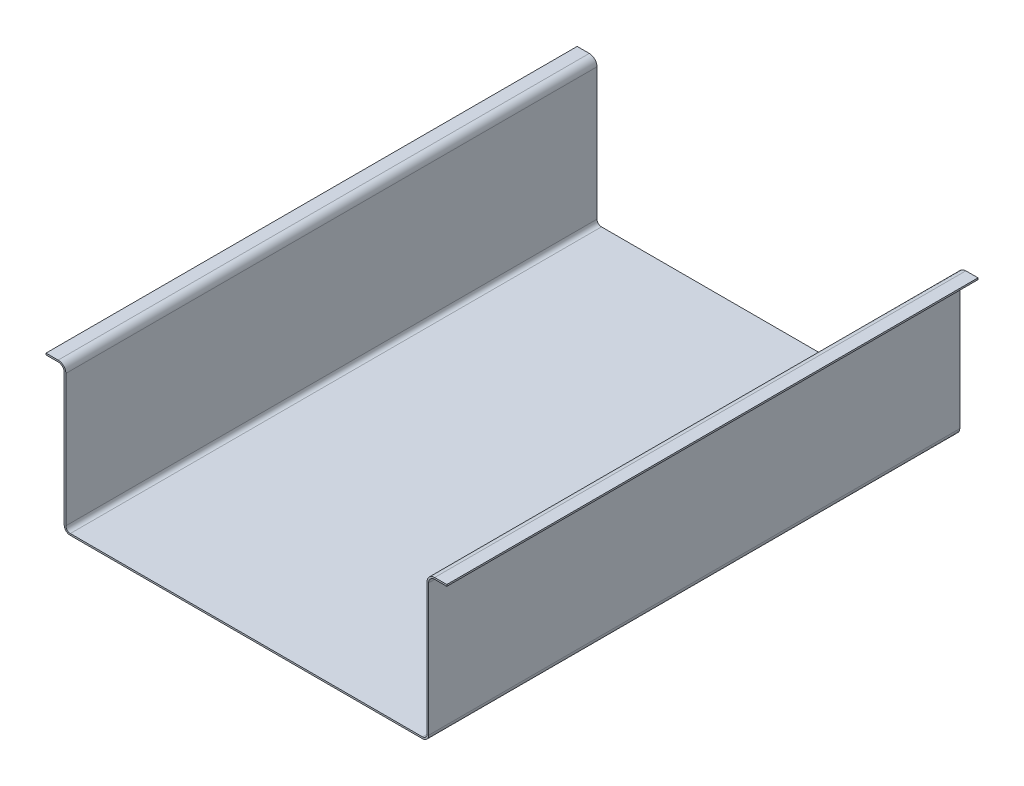
ISO-10303-21;
HEADER;
FILE_DESCRIPTION(('STEP AP214'),'2;1');
FILE_NAME('part.step','',(''),(''),'','','');
FILE_SCHEMA(('AUTOMOTIVE_DESIGN { 1 0 10303 214 1 1 1 1 }'));
ENDSEC;
DATA;
#1=APPLICATION_CONTEXT('core data for automotive mechanical design processes');
#2=APPLICATION_PROTOCOL_DEFINITION('international standard','automotive_design',2000,#1);
#3=PRODUCT_CONTEXT('',#1,'mechanical');
#4=PRODUCT('Part','Part','',(#3));
#5=PRODUCT_RELATED_PRODUCT_CATEGORY('part','',(#4));
#6=PRODUCT_DEFINITION_FORMATION('','',#4);
#7=PRODUCT_DEFINITION_CONTEXT('part definition',#1,'design');
#8=PRODUCT_DEFINITION('design','',#6,#7);
#9=PRODUCT_DEFINITION_SHAPE('','',#8);
#10=(LENGTH_UNIT() NAMED_UNIT(*) SI_UNIT(.MILLI.,.METRE.));
#11=(NAMED_UNIT(*) PLANE_ANGLE_UNIT() SI_UNIT($,.RADIAN.));
#12=(NAMED_UNIT(*) SI_UNIT($,.STERADIAN.) SOLID_ANGLE_UNIT());
#13=UNCERTAINTY_MEASURE_WITH_UNIT(LENGTH_MEASURE(1.E-05),#10,'distance_accuracy_value','');
#14=(GEOMETRIC_REPRESENTATION_CONTEXT(3) GLOBAL_UNCERTAINTY_ASSIGNED_CONTEXT((#13)) GLOBAL_UNIT_ASSIGNED_CONTEXT((#10,
#11,#12)) REPRESENTATION_CONTEXT('',''));
#15=CARTESIAN_POINT('',(0.,0.,0.));
#16=DIRECTION('',(0.,0.,1.));
#17=DIRECTION('',(1.,0.,0.));
#18=AXIS2_PLACEMENT_3D('',#15,#16,#17);
#19=CARTESIAN_POINT('',(-377.5837,-1.51893795707195E-13,555.3837));
#20=DIRECTION('',(-1.,0.,0.));
#21=DIRECTION('',(0.,-1.,0.));
#22=AXIS2_PLACEMENT_3D('',#19,#20,#21);
#23=PLANE('',#22);
#24=DIRECTION('',(0.,1.,0.));
#25=VECTOR('',#24,1.);
#26=CARTESIAN_POINT('',(-377.5837,-1.51893795707195E-13,-555.3837));
#27=LINE('',#26,#25);
#28=CARTESIAN_POINT('',(-377.5837,12.7,-555.3837));
#29=VERTEX_POINT('',#28);
#30=CARTESIAN_POINT('',(-377.5837,288.6837,-555.3837));
#31=VERTEX_POINT('',#30);
#32=EDGE_CURVE('E201',#29,#31,#27,.T.);
#33=ORIENTED_EDGE('',*,*,#32,.T.);
#34=DIRECTION('',(0.,0.,-1.));
#35=VECTOR('',#34,1.);
#36=CARTESIAN_POINT('',(-377.5837,288.6837,555.3837));
#37=LINE('',#36,#35);
#38=CARTESIAN_POINT('',(-377.5837,288.6837,555.3837));
#39=VERTEX_POINT('',#38);
#40=EDGE_CURVE('E11',#39,#31,#37,.T.);
#41=ORIENTED_EDGE('',*,*,#40,.F.);
#42=DIRECTION('',(0.,1.,0.));
#43=VECTOR('',#42,1.);
#44=CARTESIAN_POINT('',(-377.5837,-1.51893795707195E-13,555.3837));
#45=LINE('',#44,#43);
#46=CARTESIAN_POINT('',(-377.5837,12.7,555.3837));
#47=VERTEX_POINT('',#46);
#48=EDGE_CURVE('E252',#47,#39,#45,.T.);
#49=ORIENTED_EDGE('',*,*,#48,.F.);
#50=DIRECTION('',(0.,0.,-1.));
#51=VECTOR('',#50,1.);
#52=CARTESIAN_POINT('',(-377.5837,12.7,555.3837));
#53=LINE('',#52,#51);
#54=EDGE_CURVE('E197',#47,#29,#53,.T.);
#55=ORIENTED_EDGE('',*,*,#54,.T.);
#56=EDGE_LOOP('',(#33,#41,#49,#55));
#57=FACE_BOUND('',#56,.T.);
#58=ADVANCED_FACE('F35',(#57),#23,.F.);
#59=CARTESIAN_POINT('',(-393.7,288.6837,555.3837));
#60=DIRECTION('',(0.,0.,-1.));
#61=DIRECTION('',(-1.,0.,0.));
#62=AXIS2_PLACEMENT_3D('',#59,#60,#61);
#63=CYLINDRICAL_SURFACE('',#62,16.1163);
#64=CARTESIAN_POINT('',(-393.7,288.6837,-555.3837));
#65=DIRECTION('',(0.,0.,1.));
#66=DIRECTION('',(1.,0.,0.));
#67=AXIS2_PLACEMENT_3D('',#64,#65,#66);
#68=CIRCLE('',#67,16.1163);
#69=CARTESIAN_POINT('',(-393.7,304.8,-555.3837));
#70=VERTEX_POINT('',#69);
#71=EDGE_CURVE('E204',#31,#70,#68,.T.);
#72=ORIENTED_EDGE('',*,*,#71,.T.);
#73=DIRECTION('',(0.,0.,-1.));
#74=VECTOR('',#73,1.);
#75=CARTESIAN_POINT('',(-393.7,304.8,555.3837));
#76=LINE('',#75,#74);
#77=CARTESIAN_POINT('',(-393.7,304.8,555.3837));
#78=VERTEX_POINT('',#77);
#79=EDGE_CURVE('E43',#78,#70,#76,.T.);
#80=ORIENTED_EDGE('',*,*,#79,.F.);
#81=CARTESIAN_POINT('',(-393.7,288.6837,555.3837));
#82=DIRECTION('',(0.,0.,1.));
#83=DIRECTION('',(1.,0.,0.));
#84=AXIS2_PLACEMENT_3D('',#81,#82,#83);
#85=CIRCLE('',#84,16.1163);
#86=EDGE_CURVE('E126',#39,#78,#85,.T.);
#87=ORIENTED_EDGE('',*,*,#86,.F.);
#88=ORIENTED_EDGE('',*,*,#40,.T.);
#89=EDGE_LOOP('',(#72,#80,#87,#88));
#90=FACE_BOUND('',#89,.T.);
#91=ADVANCED_FACE('F357',(#90),#63,.T.);
#92=CARTESIAN_POINT('',(6.66133814775092E-13,304.799999999999,555.3837));
#93=DIRECTION('',(0.,-1.,0.));
#94=DIRECTION('',(1.,0.,0.));
#95=AXIS2_PLACEMENT_3D('',#92,#93,#94);
#96=PLANE('',#95);
#97=DIRECTION('',(-1.,0.,0.));
#98=VECTOR('',#97,1.);
#99=CARTESIAN_POINT('',(6.66133814775092E-13,304.799999999999,-555.3837));
#100=LINE('',#99,#98);
#101=CARTESIAN_POINT('',(-419.1,304.8,-555.3837));
#102=VERTEX_POINT('',#101);
#103=EDGE_CURVE('E206',#70,#102,#100,.T.);
#104=ORIENTED_EDGE('',*,*,#103,.T.);
#105=DIRECTION('',(0.,0.,-1.));
#106=VECTOR('',#105,1.);
#107=CARTESIAN_POINT('',(-419.1,304.8,555.3837));
#108=LINE('',#107,#106);
#109=CARTESIAN_POINT('',(-419.1,304.8,555.3837));
#110=VERTEX_POINT('',#109);
#111=EDGE_CURVE('E284',#110,#102,#108,.T.);
#112=ORIENTED_EDGE('',*,*,#111,.F.);
#113=DIRECTION('',(-1.,0.,0.));
#114=VECTOR('',#113,1.);
#115=CARTESIAN_POINT('',(6.66133814775092E-13,304.799999999999,555.3837));
#116=LINE('',#115,#114);
#117=EDGE_CURVE('E292',#78,#110,#116,.T.);
#118=ORIENTED_EDGE('',*,*,#117,.F.);
#119=ORIENTED_EDGE('',*,*,#79,.T.);
#120=EDGE_LOOP('',(#104,#112,#118,#119));
#121=FACE_BOUND('',#120,.T.);
#122=ADVANCED_FACE('F290',(#121),#96,.F.);
#123=CARTESIAN_POINT('',(-419.1,0.,555.3837));
#124=DIRECTION('',(1.,0.,0.));
#125=DIRECTION('',(0.,0.,-1.));
#126=AXIS2_PLACEMENT_3D('',#123,#124,#125);
#127=PLANE('',#126);
#128=DIRECTION('',(0.,-1.,0.));
#129=VECTOR('',#128,1.);
#130=CARTESIAN_POINT('',(-419.1,0.,-555.3837));
#131=LINE('',#130,#129);
#132=CARTESIAN_POINT('',(-419.1,301.3837,-555.3837));
#133=VERTEX_POINT('',#132);
#134=EDGE_CURVE('E208',#102,#133,#131,.T.);
#135=ORIENTED_EDGE('',*,*,#134,.T.);
#136=DIRECTION('',(0.,0.,-1.));
#137=VECTOR('',#136,1.);
#138=CARTESIAN_POINT('',(-419.1,301.3837,555.3837));
#139=LINE('',#138,#137);
#140=CARTESIAN_POINT('',(-419.1,301.3837,555.3837));
#141=VERTEX_POINT('',#140);
#142=EDGE_CURVE('E282',#141,#133,#139,.T.);
#143=ORIENTED_EDGE('',*,*,#142,.F.);
#144=DIRECTION('',(0.,-1.,0.));
#145=VECTOR('',#144,1.);
#146=CARTESIAN_POINT('',(-419.1,0.,555.3837));
#147=LINE('',#146,#145);
#148=EDGE_CURVE('E303',#110,#141,#147,.T.);
#149=ORIENTED_EDGE('',*,*,#148,.F.);
#150=ORIENTED_EDGE('',*,*,#111,.T.);
#151=EDGE_LOOP('',(#135,#143,#149,#150));
#152=FACE_BOUND('',#151,.T.);
#153=ADVANCED_FACE('F300',(#152),#127,.F.);
#154=CARTESIAN_POINT('',(0.,301.3837,555.3837));
#155=DIRECTION('',(0.,-1.,0.));
#156=DIRECTION('',(0.,0.,-1.));
#157=AXIS2_PLACEMENT_3D('',#154,#155,#156);
#158=PLANE('',#157);
#159=DIRECTION('',(-1.,0.,0.));
#160=VECTOR('',#159,1.);
#161=CARTESIAN_POINT('',(0.,301.3837,-555.3837));
#162=LINE('',#161,#160);
#163=CARTESIAN_POINT('',(-393.7,301.3837,-555.3837));
#164=VERTEX_POINT('',#163);
#165=EDGE_CURVE('E211',#164,#133,#162,.T.);
#166=ORIENTED_EDGE('',*,*,#165,.F.);
#167=DIRECTION('',(0.,0.,-1.));
#168=VECTOR('',#167,1.);
#169=CARTESIAN_POINT('',(-393.7,301.3837,555.3837));
#170=LINE('',#169,#168);
#171=CARTESIAN_POINT('',(-393.7,301.3837,555.3837));
#172=VERTEX_POINT('',#171);
#173=EDGE_CURVE('E280',#172,#164,#170,.T.);
#174=ORIENTED_EDGE('',*,*,#173,.F.);
#175=DIRECTION('',(-1.,0.,0.));
#176=VECTOR('',#175,1.);
#177=CARTESIAN_POINT('',(0.,301.3837,555.3837));
#178=LINE('',#177,#176);
#179=EDGE_CURVE('E305',#172,#141,#178,.T.);
#180=ORIENTED_EDGE('',*,*,#179,.T.);
#181=ORIENTED_EDGE('',*,*,#142,.T.);
#182=EDGE_LOOP('',(#166,#174,#180,#181));
#183=FACE_BOUND('',#182,.T.);
#184=ADVANCED_FACE('F368',(#183),#158,.T.);
#185=CARTESIAN_POINT('',(-393.7,288.6837,555.3837));
#186=DIRECTION('',(0.,0.,-1.));
#187=DIRECTION('',(-1.,0.,0.));
#188=AXIS2_PLACEMENT_3D('',#185,#186,#187);
#189=CYLINDRICAL_SURFACE('',#188,12.7);
#190=CARTESIAN_POINT('',(-393.7,288.6837,-555.3837));
#191=DIRECTION('',(0.,0.,1.));
#192=DIRECTION('',(1.,0.,0.));
#193=AXIS2_PLACEMENT_3D('',#190,#191,#192);
#194=CIRCLE('',#193,12.7);
#195=CARTESIAN_POINT('',(-381.,288.6837,-555.3837));
#196=VERTEX_POINT('',#195);
#197=EDGE_CURVE('E214',#196,#164,#194,.T.);
#198=ORIENTED_EDGE('',*,*,#197,.F.);
#199=DIRECTION('',(0.,0.,-1.));
#200=VECTOR('',#199,1.);
#201=CARTESIAN_POINT('',(-381.,288.6837,555.3837));
#202=LINE('',#201,#200);
#203=CARTESIAN_POINT('',(-381.,288.6837,555.3837));
#204=VERTEX_POINT('',#203);
#205=EDGE_CURVE('E278',#204,#196,#202,.T.);
#206=ORIENTED_EDGE('',*,*,#205,.F.);
#207=CARTESIAN_POINT('',(-393.7,288.6837,555.3837));
#208=DIRECTION('',(0.,0.,1.));
#209=DIRECTION('',(1.,0.,0.));
#210=AXIS2_PLACEMENT_3D('',#207,#208,#209);
#211=CIRCLE('',#210,12.7);
#212=EDGE_CURVE('E307',#204,#172,#211,.T.);
#213=ORIENTED_EDGE('',*,*,#212,.T.);
#214=ORIENTED_EDGE('',*,*,#173,.T.);
#215=EDGE_LOOP('',(#198,#206,#213,#214));
#216=FACE_BOUND('',#215,.T.);
#217=ADVANCED_FACE('F371',(#216),#189,.F.);
#218=CARTESIAN_POINT('',(-381.,-2.29902149501321E-13,555.3837));
#219=DIRECTION('',(-1.,0.,0.));
#220=DIRECTION('',(0.,-1.,0.));
#221=AXIS2_PLACEMENT_3D('',#218,#219,#220);
#222=PLANE('',#221);
#223=DIRECTION('',(0.,1.,0.));
#224=VECTOR('',#223,1.);
#225=CARTESIAN_POINT('',(-381.,-2.29902149501321E-13,-555.3837));
#226=LINE('',#225,#224);
#227=CARTESIAN_POINT('',(-381.,12.7,-555.3837));
#228=VERTEX_POINT('',#227);
#229=EDGE_CURVE('E217',#228,#196,#226,.T.);
#230=ORIENTED_EDGE('',*,*,#229,.F.);
#231=DIRECTION('',(0.,0.,-1.));
#232=VECTOR('',#231,1.);
#233=CARTESIAN_POINT('',(-381.,12.7,555.3837));
#234=LINE('',#233,#232);
#235=CARTESIAN_POINT('',(-381.,12.7,555.3837));
#236=VERTEX_POINT('',#235);
#237=EDGE_CURVE('E276',#236,#228,#234,.T.);
#238=ORIENTED_EDGE('',*,*,#237,.F.);
#239=DIRECTION('',(0.,1.,0.));
#240=VECTOR('',#239,1.);
#241=CARTESIAN_POINT('',(-381.,-2.29902149501321E-13,555.3837));
#242=LINE('',#241,#240);
#243=EDGE_CURVE('E314',#236,#204,#242,.T.);
#244=ORIENTED_EDGE('',*,*,#243,.T.);
#245=ORIENTED_EDGE('',*,*,#205,.T.);
#246=EDGE_LOOP('',(#230,#238,#244,#245));
#247=FACE_BOUND('',#246,.T.);
#248=ADVANCED_FACE('F375',(#247),#222,.T.);
#249=CARTESIAN_POINT('',(-368.3,12.7,555.3837));
#250=DIRECTION('',(0.,0.,-1.));
#251=DIRECTION('',(-1.,0.,0.));
#252=AXIS2_PLACEMENT_3D('',#249,#250,#251);
#253=CYLINDRICAL_SURFACE('',#252,12.7);
#254=CARTESIAN_POINT('',(-368.3,12.7,-555.3837));
#255=DIRECTION('',(0.,0.,1.));
#256=DIRECTION('',(1.,0.,0.));
#257=AXIS2_PLACEMENT_3D('',#254,#255,#256);
#258=CIRCLE('',#257,12.7);
#259=CARTESIAN_POINT('',(-368.3,0.,-555.3837));
#260=VERTEX_POINT('',#259);
#261=EDGE_CURVE('E220',#260,#228,#258,.F.);
#262=ORIENTED_EDGE('',*,*,#261,.F.);
#263=DIRECTION('',(0.,0.,-1.));
#264=VECTOR('',#263,1.);
#265=CARTESIAN_POINT('',(-368.3,0.,555.3837));
#266=LINE('',#265,#264);
#267=CARTESIAN_POINT('',(-368.3,0.,555.3837));
#268=VERTEX_POINT('',#267);
#269=EDGE_CURVE('E274',#268,#260,#266,.T.);
#270=ORIENTED_EDGE('',*,*,#269,.F.);
#271=CARTESIAN_POINT('',(-368.3,12.7,555.3837));
#272=DIRECTION('',(0.,0.,1.));
#273=DIRECTION('',(1.,0.,0.));
#274=AXIS2_PLACEMENT_3D('',#271,#272,#273);
#275=CIRCLE('',#274,12.7);
#276=EDGE_CURVE('E317',#268,#236,#275,.F.);
#277=ORIENTED_EDGE('',*,*,#276,.T.);
#278=ORIENTED_EDGE('',*,*,#237,.T.);
#279=EDGE_LOOP('',(#262,#270,#277,#278));
#280=FACE_BOUND('',#279,.T.);
#281=ADVANCED_FACE('F379',(#280),#253,.T.);
#282=CARTESIAN_POINT('',(0.,0.,555.3837));
#283=DIRECTION('',(0.,1.,0.));
#284=DIRECTION('',(-1.,0.,0.));
#285=AXIS2_PLACEMENT_3D('',#282,#283,#284);
#286=PLANE('',#285);
#287=DIRECTION('',(1.,0.,0.));
#288=VECTOR('',#287,1.);
#289=CARTESIAN_POINT('',(0.,0.,-555.3837));
#290=LINE('',#289,#288);
#291=CARTESIAN_POINT('',(368.3,1.35308431126191E-13,-555.3837));
#292=VERTEX_POINT('',#291);
#293=EDGE_CURVE('E223',#260,#292,#290,.T.);
#294=ORIENTED_EDGE('',*,*,#293,.T.);
#295=DIRECTION('',(0.,0.,-1.));
#296=VECTOR('',#295,1.);
#297=CARTESIAN_POINT('',(368.3,1.35308431126191E-13,555.3837));
#298=LINE('',#297,#296);
#299=CARTESIAN_POINT('',(368.3,1.35308431126191E-13,555.3837));
#300=VERTEX_POINT('',#299);
#301=EDGE_CURVE('E271',#300,#292,#298,.T.);
#302=ORIENTED_EDGE('',*,*,#301,.F.);
#303=DIRECTION('',(1.,0.,0.));
#304=VECTOR('',#303,1.);
#305=CARTESIAN_POINT('',(0.,0.,555.3837));
#306=LINE('',#305,#304);
#307=EDGE_CURVE('E320',#268,#300,#306,.T.);
#308=ORIENTED_EDGE('',*,*,#307,.F.);
#309=ORIENTED_EDGE('',*,*,#269,.T.);
#310=EDGE_LOOP('',(#294,#302,#308,#309));
#311=FACE_BOUND('',#310,.T.);
#312=ADVANCED_FACE('F383',(#311),#286,.F.);
#313=CARTESIAN_POINT('',(368.3,12.7000000000001,555.3837));
#314=DIRECTION('',(0.,0.,-1.));
#315=DIRECTION('',(-1.,0.,0.));
#316=AXIS2_PLACEMENT_3D('',#313,#314,#315);
#317=CYLINDRICAL_SURFACE('',#316,12.7);
#318=CARTESIAN_POINT('',(368.3,12.7000000000001,-555.3837));
#319=DIRECTION('',(0.,0.,1.));
#320=DIRECTION('',(1.,0.,0.));
#321=AXIS2_PLACEMENT_3D('',#318,#319,#320);
#322=CIRCLE('',#321,12.7);
#323=CARTESIAN_POINT('',(381.,12.7000000000001,-555.3837));
#324=VERTEX_POINT('',#323);
#325=EDGE_CURVE('E225',#292,#324,#322,.T.);
#326=ORIENTED_EDGE('',*,*,#325,.T.);
#327=DIRECTION('',(0.,0.,-1.));
#328=VECTOR('',#327,1.);
#329=CARTESIAN_POINT('',(381.,12.7000000000001,555.3837));
#330=LINE('',#329,#328);
#331=CARTESIAN_POINT('',(381.,12.7000000000001,555.3837));
#332=VERTEX_POINT('',#331);
#333=EDGE_CURVE('E268',#332,#324,#330,.T.);
#334=ORIENTED_EDGE('',*,*,#333,.F.);
#335=CARTESIAN_POINT('',(368.3,12.7000000000001,555.3837));
#336=DIRECTION('',(0.,0.,1.));
#337=DIRECTION('',(1.,0.,0.));
#338=AXIS2_PLACEMENT_3D('',#335,#336,#337);
#339=CIRCLE('',#338,12.7);
#340=EDGE_CURVE('E322',#300,#332,#339,.T.);
#341=ORIENTED_EDGE('',*,*,#340,.F.);
#342=ORIENTED_EDGE('',*,*,#301,.T.);
#343=EDGE_LOOP('',(#326,#334,#341,#342));
#344=FACE_BOUND('',#343,.T.);
#345=ADVANCED_FACE('F387',(#344),#317,.T.);
#346=CARTESIAN_POINT('',(381.,0.,555.3837));
#347=DIRECTION('',(-1.,0.,0.));
#348=DIRECTION('',(0.,0.,1.));
#349=AXIS2_PLACEMENT_3D('',#346,#347,#348);
#350=PLANE('',#349);
#351=DIRECTION('',(0.,1.,0.));
#352=VECTOR('',#351,1.);
#353=CARTESIAN_POINT('',(381.,0.,-555.3837));
#354=LINE('',#353,#352);
#355=CARTESIAN_POINT('',(381.,288.6837,-555.3837));
#356=VERTEX_POINT('',#355);
#357=EDGE_CURVE('E227',#324,#356,#354,.T.);
#358=ORIENTED_EDGE('',*,*,#357,.T.);
#359=DIRECTION('',(0.,0.,-1.));
#360=VECTOR('',#359,1.);
#361=CARTESIAN_POINT('',(381.,288.6837,555.3837));
#362=LINE('',#361,#360);
#363=CARTESIAN_POINT('',(381.,288.6837,555.3837));
#364=VERTEX_POINT('',#363);
#365=EDGE_CURVE('E266',#364,#356,#362,.T.);
#366=ORIENTED_EDGE('',*,*,#365,.F.);
#367=DIRECTION('',(0.,1.,0.));
#368=VECTOR('',#367,1.);
#369=CARTESIAN_POINT('',(381.,0.,555.3837));
#370=LINE('',#369,#368);
#371=EDGE_CURVE('E324',#332,#364,#370,.T.);
#372=ORIENTED_EDGE('',*,*,#371,.F.);
#373=ORIENTED_EDGE('',*,*,#333,.T.);
#374=EDGE_LOOP('',(#358,#366,#372,#373));
#375=FACE_BOUND('',#374,.T.);
#376=ADVANCED_FACE('F391',(#375),#350,.F.);
#377=CARTESIAN_POINT('',(393.7,288.6837,555.3837));
#378=DIRECTION('',(0.,0.,-1.));
#379=DIRECTION('',(-1.,0.,0.));
#380=AXIS2_PLACEMENT_3D('',#377,#378,#379);
#381=CYLINDRICAL_SURFACE('',#380,12.7);
#382=CARTESIAN_POINT('',(393.7,288.6837,-555.3837));
#383=DIRECTION('',(0.,0.,1.));
#384=DIRECTION('',(1.,0.,0.));
#385=AXIS2_PLACEMENT_3D('',#382,#383,#384);
#386=CIRCLE('',#385,12.7);
#387=CARTESIAN_POINT('',(393.7,301.3837,-555.3837));
#388=VERTEX_POINT('',#387);
#389=EDGE_CURVE('E230',#388,#356,#386,.T.);
#390=ORIENTED_EDGE('',*,*,#389,.F.);
#391=DIRECTION('',(0.,0.,-1.));
#392=VECTOR('',#391,1.);
#393=CARTESIAN_POINT('',(393.7,301.3837,555.3837));
#394=LINE('',#393,#392);
#395=CARTESIAN_POINT('',(393.7,301.3837,555.3837));
#396=VERTEX_POINT('',#395);
#397=EDGE_CURVE('E264',#396,#388,#394,.T.);
#398=ORIENTED_EDGE('',*,*,#397,.F.);
#399=CARTESIAN_POINT('',(393.7,288.6837,555.3837));
#400=DIRECTION('',(0.,0.,1.));
#401=DIRECTION('',(1.,0.,0.));
#402=AXIS2_PLACEMENT_3D('',#399,#400,#401);
#403=CIRCLE('',#402,12.7);
#404=EDGE_CURVE('E326',#396,#364,#403,.T.);
#405=ORIENTED_EDGE('',*,*,#404,.T.);
#406=ORIENTED_EDGE('',*,*,#365,.T.);
#407=EDGE_LOOP('',(#390,#398,#405,#406));
#408=FACE_BOUND('',#407,.T.);
#409=ADVANCED_FACE('F395',(#408),#381,.F.);
#410=CARTESIAN_POINT('',(-1.31733512986897E-12,301.383699999998,555.3837));
#411=DIRECTION('',(0.,1.,0.));
#412=DIRECTION('',(-1.,0.,0.));
#413=AXIS2_PLACEMENT_3D('',#410,#411,#412);
#414=PLANE('',#413);
#415=DIRECTION('',(1.,0.,0.));
#416=VECTOR('',#415,1.);
#417=CARTESIAN_POINT('',(-1.31733512986897E-12,301.383699999998,-555.3837));
#418=LINE('',#417,#416);
#419=CARTESIAN_POINT('',(419.1,301.3837,-555.3837));
#420=VERTEX_POINT('',#419);
#421=EDGE_CURVE('E233',#388,#420,#418,.T.);
#422=ORIENTED_EDGE('',*,*,#421,.T.);
#423=DIRECTION('',(0.,0.,-1.));
#424=VECTOR('',#423,1.);
#425=CARTESIAN_POINT('',(419.1,301.3837,555.3837));
#426=LINE('',#425,#424);
#427=CARTESIAN_POINT('',(419.1,301.3837,555.3837));
#428=VERTEX_POINT('',#427);
#429=EDGE_CURVE('E262',#428,#420,#426,.T.);
#430=ORIENTED_EDGE('',*,*,#429,.F.);
#431=DIRECTION('',(1.,0.,0.));
#432=VECTOR('',#431,1.);
#433=CARTESIAN_POINT('',(-1.31733512986897E-12,301.383699999998,555.3837));
#434=LINE('',#433,#432);
#435=EDGE_CURVE('E329',#396,#428,#434,.T.);
#436=ORIENTED_EDGE('',*,*,#435,.F.);
#437=ORIENTED_EDGE('',*,*,#397,.T.);
#438=EDGE_LOOP('',(#422,#430,#436,#437));
#439=FACE_BOUND('',#438,.T.);
#440=ADVANCED_FACE('F399',(#439),#414,.F.);
#441=CARTESIAN_POINT('',(419.1,0.,555.3837));
#442=DIRECTION('',(1.,0.,0.));
#443=DIRECTION('',(0.,0.,-1.));
#444=AXIS2_PLACEMENT_3D('',#441,#442,#443);
#445=PLANE('',#444);
#446=DIRECTION('',(0.,-1.,0.));
#447=VECTOR('',#446,1.);
#448=CARTESIAN_POINT('',(419.1,0.,-555.3837));
#449=LINE('',#448,#447);
#450=CARTESIAN_POINT('',(419.1,304.8,-555.3837));
#451=VERTEX_POINT('',#450);
#452=EDGE_CURVE('E236',#451,#420,#449,.T.);
#453=ORIENTED_EDGE('',*,*,#452,.F.);
#454=DIRECTION('',(0.,0.,-1.));
#455=VECTOR('',#454,1.);
#456=CARTESIAN_POINT('',(419.1,304.8,555.3837));
#457=LINE('',#456,#455);
#458=CARTESIAN_POINT('',(419.1,304.8,555.3837));
#459=VERTEX_POINT('',#458);
#460=EDGE_CURVE('E260',#459,#451,#457,.T.);
#461=ORIENTED_EDGE('',*,*,#460,.F.);
#462=DIRECTION('',(0.,-1.,0.));
#463=VECTOR('',#462,1.);
#464=CARTESIAN_POINT('',(419.1,0.,555.3837));
#465=LINE('',#464,#463);
#466=EDGE_CURVE('E331',#459,#428,#465,.T.);
#467=ORIENTED_EDGE('',*,*,#466,.T.);
#468=ORIENTED_EDGE('',*,*,#429,.T.);
#469=EDGE_LOOP('',(#453,#461,#467,#468));
#470=FACE_BOUND('',#469,.T.);
#471=ADVANCED_FACE('F403',(#470),#445,.T.);
#472=CARTESIAN_POINT('',(-1.33226762955018E-12,304.799999999998,555.3837));
#473=DIRECTION('',(0.,1.,0.));
#474=DIRECTION('',(-1.,0.,0.));
#475=AXIS2_PLACEMENT_3D('',#472,#473,#474);
#476=PLANE('',#475);
#477=DIRECTION('',(1.,0.,0.));
#478=VECTOR('',#477,1.);
#479=CARTESIAN_POINT('',(-1.33226762955018E-12,304.799999999998,-555.3837));
#480=LINE('',#479,#478);
#481=CARTESIAN_POINT('',(393.7,304.8,-555.3837));
#482=VERTEX_POINT('',#481);
#483=EDGE_CURVE('E239',#482,#451,#480,.T.);
#484=ORIENTED_EDGE('',*,*,#483,.F.);
#485=DIRECTION('',(0.,0.,-1.));
#486=VECTOR('',#485,1.);
#487=CARTESIAN_POINT('',(393.7,304.8,555.3837));
#488=LINE('',#487,#486);
#489=CARTESIAN_POINT('',(393.7,304.8,555.3837));
#490=VERTEX_POINT('',#489);
#491=EDGE_CURVE('E258',#490,#482,#488,.T.);
#492=ORIENTED_EDGE('',*,*,#491,.F.);
#493=DIRECTION('',(1.,0.,0.));
#494=VECTOR('',#493,1.);
#495=CARTESIAN_POINT('',(-1.33226762955018E-12,304.799999999998,555.3837));
#496=LINE('',#495,#494);
#497=EDGE_CURVE('E334',#490,#459,#496,.T.);
#498=ORIENTED_EDGE('',*,*,#497,.T.);
#499=ORIENTED_EDGE('',*,*,#460,.T.);
#500=EDGE_LOOP('',(#484,#492,#498,#499));
#501=FACE_BOUND('',#500,.T.);
#502=ADVANCED_FACE('F407',(#501),#476,.T.);
#503=CARTESIAN_POINT('',(393.7,288.6837,555.3837));
#504=DIRECTION('',(0.,0.,-1.));
#505=DIRECTION('',(-1.,0.,0.));
#506=AXIS2_PLACEMENT_3D('',#503,#504,#505);
#507=CYLINDRICAL_SURFACE('',#506,16.1163);
#508=CARTESIAN_POINT('',(393.7,288.6837,-555.3837));
#509=DIRECTION('',(0.,0.,1.));
#510=DIRECTION('',(1.,0.,0.));
#511=AXIS2_PLACEMENT_3D('',#508,#509,#510);
#512=CIRCLE('',#511,16.1163);
#513=CARTESIAN_POINT('',(377.5837,288.6837,-555.3837));
#514=VERTEX_POINT('',#513);
#515=EDGE_CURVE('E242',#482,#514,#512,.T.);
#516=ORIENTED_EDGE('',*,*,#515,.T.);
#517=DIRECTION('',(0.,0.,-1.));
#518=VECTOR('',#517,1.);
#519=CARTESIAN_POINT('',(377.5837,288.6837,555.3837));
#520=LINE('',#519,#518);
#521=CARTESIAN_POINT('',(377.5837,288.6837,555.3837));
#522=VERTEX_POINT('',#521);
#523=EDGE_CURVE('E256',#522,#514,#520,.T.);
#524=ORIENTED_EDGE('',*,*,#523,.F.);
#525=CARTESIAN_POINT('',(393.7,288.6837,555.3837));
#526=DIRECTION('',(0.,0.,1.));
#527=DIRECTION('',(1.,0.,0.));
#528=AXIS2_PLACEMENT_3D('',#525,#526,#527);
#529=CIRCLE('',#528,16.1163);
#530=EDGE_CURVE('E337',#490,#522,#529,.T.);
#531=ORIENTED_EDGE('',*,*,#530,.F.);
#532=ORIENTED_EDGE('',*,*,#491,.T.);
#533=EDGE_LOOP('',(#516,#524,#531,#532));
#534=FACE_BOUND('',#533,.T.);
#535=ADVANCED_FACE('F411',(#534),#507,.T.);
#536=CARTESIAN_POINT('',(377.5837,0.,555.3837));
#537=DIRECTION('',(-1.,0.,0.));
#538=DIRECTION('',(0.,0.,1.));
#539=AXIS2_PLACEMENT_3D('',#536,#537,#538);
#540=PLANE('',#539);
#541=DIRECTION('',(0.,1.,0.));
#542=VECTOR('',#541,1.);
#543=CARTESIAN_POINT('',(377.5837,0.,-555.3837));
#544=LINE('',#543,#542);
#545=CARTESIAN_POINT('',(377.5837,12.7000000000001,-555.3837));
#546=VERTEX_POINT('',#545);
#547=EDGE_CURVE('E245',#546,#514,#544,.T.);
#548=ORIENTED_EDGE('',*,*,#547,.F.);
#549=DIRECTION('',(0.,0.,-1.));
#550=VECTOR('',#549,1.);
#551=CARTESIAN_POINT('',(377.5837,12.7000000000001,555.3837));
#552=LINE('',#551,#550);
#553=CARTESIAN_POINT('',(377.5837,12.7000000000001,555.3837));
#554=VERTEX_POINT('',#553);
#555=EDGE_CURVE('E187',#554,#546,#552,.T.);
#556=ORIENTED_EDGE('',*,*,#555,.F.);
#557=DIRECTION('',(0.,1.,0.));
#558=VECTOR('',#557,1.);
#559=CARTESIAN_POINT('',(377.5837,0.,555.3837));
#560=LINE('',#559,#558);
#561=EDGE_CURVE('E193',#554,#522,#560,.T.);
#562=ORIENTED_EDGE('',*,*,#561,.T.);
#563=ORIENTED_EDGE('',*,*,#523,.T.);
#564=EDGE_LOOP('',(#548,#556,#562,#563));
#565=FACE_BOUND('',#564,.T.);
#566=ADVANCED_FACE('F340',(#565),#540,.T.);
#567=CARTESIAN_POINT('',(368.3,12.7000000000001,555.3837));
#568=DIRECTION('',(0.,0.,-1.));
#569=DIRECTION('',(-1.,0.,0.));
#570=AXIS2_PLACEMENT_3D('',#567,#568,#569);
#571=CYLINDRICAL_SURFACE('',#570,9.2837);
#572=CARTESIAN_POINT('',(368.3,12.7000000000001,-555.3837));
#573=DIRECTION('',(0.,0.,1.));
#574=DIRECTION('',(1.,0.,0.));
#575=AXIS2_PLACEMENT_3D('',#572,#573,#574);
#576=CIRCLE('',#575,9.2837);
#577=CARTESIAN_POINT('',(368.3,3.41630000000014,-555.3837));
#578=VERTEX_POINT('',#577);
#579=EDGE_CURVE('E182',#578,#546,#576,.T.);
#580=ORIENTED_EDGE('',*,*,#579,.F.);
#581=DIRECTION('',(0.,0.,-1.));
#582=VECTOR('',#581,1.);
#583=CARTESIAN_POINT('',(368.3,3.41630000000014,555.3837));
#584=LINE('',#583,#582);
#585=CARTESIAN_POINT('',(368.3,3.41630000000014,555.3837));
#586=VERTEX_POINT('',#585);
#587=EDGE_CURVE('E177',#586,#578,#584,.T.);
#588=ORIENTED_EDGE('',*,*,#587,.F.);
#589=CARTESIAN_POINT('',(368.3,12.7000000000001,555.3837));
#590=DIRECTION('',(0.,0.,1.));
#591=DIRECTION('',(1.,0.,0.));
#592=AXIS2_PLACEMENT_3D('',#589,#590,#591);
#593=CIRCLE('',#592,9.2837);
#594=EDGE_CURVE('E180',#586,#554,#593,.T.);
#595=ORIENTED_EDGE('',*,*,#594,.T.);
#596=ORIENTED_EDGE('',*,*,#555,.T.);
#597=EDGE_LOOP('',(#580,#588,#595,#596));
#598=FACE_BOUND('',#597,.T.);
#599=ADVANCED_FACE('F179',(#598),#571,.F.);
#600=CARTESIAN_POINT('',(0.,3.41630000000007,555.3837));
#601=DIRECTION('',(0.,1.,0.));
#602=DIRECTION('',(-1.,0.,0.));
#603=AXIS2_PLACEMENT_3D('',#600,#601,#602);
#604=PLANE('',#603);
#605=DIRECTION('',(1.,0.,0.));
#606=VECTOR('',#605,1.);
#607=CARTESIAN_POINT('',(0.,3.41630000000007,-555.3837));
#608=LINE('',#607,#606);
#609=CARTESIAN_POINT('',(-368.3,3.4163,-555.3837));
#610=VERTEX_POINT('',#609);
#611=EDGE_CURVE('E249',#610,#578,#608,.T.);
#612=ORIENTED_EDGE('',*,*,#611,.F.);
#613=DIRECTION('',(0.,0.,-1.));
#614=VECTOR('',#613,1.);
#615=CARTESIAN_POINT('',(-368.3,3.4163,555.3837));
#616=LINE('',#615,#614);
#617=CARTESIAN_POINT('',(-368.3,3.4163,555.3837));
#618=VERTEX_POINT('',#617);
#619=EDGE_CURVE('E115',#618,#610,#616,.T.);
#620=ORIENTED_EDGE('',*,*,#619,.F.);
#621=DIRECTION('',(1.,0.,0.));
#622=VECTOR('',#621,1.);
#623=CARTESIAN_POINT('',(0.,3.41630000000007,555.3837));
#624=LINE('',#623,#622);
#625=EDGE_CURVE('E191',#618,#586,#624,.T.);
#626=ORIENTED_EDGE('',*,*,#625,.T.);
#627=ORIENTED_EDGE('',*,*,#587,.T.);
#628=EDGE_LOOP('',(#612,#620,#626,#627));
#629=FACE_BOUND('',#628,.T.);
#630=ADVANCED_FACE('F195',(#629),#604,.T.);
#631=CARTESIAN_POINT('',(-368.3,12.7,555.3837));
#632=DIRECTION('',(0.,0.,-1.));
#633=DIRECTION('',(-1.,0.,0.));
#634=AXIS2_PLACEMENT_3D('',#631,#632,#633);
#635=CYLINDRICAL_SURFACE('',#634,9.2837);
#636=CARTESIAN_POINT('',(-368.3,12.7,-555.3837));
#637=DIRECTION('',(0.,0.,1.));
#638=DIRECTION('',(1.,0.,0.));
#639=AXIS2_PLACEMENT_3D('',#636,#637,#638);
#640=CIRCLE('',#639,9.2837);
#641=EDGE_CURVE('E118',#610,#29,#640,.F.);
#642=ORIENTED_EDGE('',*,*,#641,.T.);
#643=ORIENTED_EDGE('',*,*,#54,.F.);
#644=CARTESIAN_POINT('',(-368.3,12.7,555.3837));
#645=DIRECTION('',(0.,0.,1.));
#646=DIRECTION('',(1.,0.,0.));
#647=AXIS2_PLACEMENT_3D('',#644,#645,#646);
#648=CIRCLE('',#647,9.2837);
#649=EDGE_CURVE('E51',#618,#47,#648,.F.);
#650=ORIENTED_EDGE('',*,*,#649,.F.);
#651=ORIENTED_EDGE('',*,*,#619,.T.);
#652=EDGE_LOOP('',(#642,#643,#650,#651));
#653=FACE_BOUND('',#652,.T.);
#654=ADVANCED_FACE('F346',(#653),#635,.F.);
#655=CARTESIAN_POINT('',(0.,0.,555.3837));
#656=DIRECTION('',(0.,0.,1.));
#657=DIRECTION('',(1.,0.,0.));
#658=AXIS2_PLACEMENT_3D('',#655,#656,#657);
#659=PLANE('',#658);
#660=ORIENTED_EDGE('',*,*,#48,.T.);
#661=ORIENTED_EDGE('',*,*,#86,.T.);
#662=ORIENTED_EDGE('',*,*,#117,.T.);
#663=ORIENTED_EDGE('',*,*,#148,.T.);
#664=ORIENTED_EDGE('',*,*,#179,.F.);
#665=ORIENTED_EDGE('',*,*,#212,.F.);
#666=ORIENTED_EDGE('',*,*,#243,.F.);
#667=ORIENTED_EDGE('',*,*,#276,.F.);
#668=ORIENTED_EDGE('',*,*,#307,.T.);
#669=ORIENTED_EDGE('',*,*,#340,.T.);
#670=ORIENTED_EDGE('',*,*,#371,.T.);
#671=ORIENTED_EDGE('',*,*,#404,.F.);
#672=ORIENTED_EDGE('',*,*,#435,.T.);
#673=ORIENTED_EDGE('',*,*,#466,.F.);
#674=ORIENTED_EDGE('',*,*,#497,.F.);
#675=ORIENTED_EDGE('',*,*,#530,.T.);
#676=ORIENTED_EDGE('',*,*,#561,.F.);
#677=ORIENTED_EDGE('',*,*,#594,.F.);
#678=ORIENTED_EDGE('',*,*,#625,.F.);
#679=ORIENTED_EDGE('',*,*,#649,.T.);
#680=EDGE_LOOP('',(#660,#661,#662,#663,#664,#665,#666,#667,#668,#669,#670,#671,#672,#673,#674,
#675,#676,#677,#678,#679));
#681=FACE_BOUND('',#680,.T.);
#682=ADVANCED_FACE('F190',(#681),#659,.T.);
#683=CARTESIAN_POINT('',(0.,0.,-555.3837));
#684=DIRECTION('',(0.,0.,1.));
#685=DIRECTION('',(1.,0.,0.));
#686=AXIS2_PLACEMENT_3D('',#683,#684,#685);
#687=PLANE('',#686);
#688=ORIENTED_EDGE('',*,*,#32,.F.);
#689=ORIENTED_EDGE('',*,*,#641,.F.);
#690=ORIENTED_EDGE('',*,*,#611,.T.);
#691=ORIENTED_EDGE('',*,*,#579,.T.);
#692=ORIENTED_EDGE('',*,*,#547,.T.);
#693=ORIENTED_EDGE('',*,*,#515,.F.);
#694=ORIENTED_EDGE('',*,*,#483,.T.);
#695=ORIENTED_EDGE('',*,*,#452,.T.);
#696=ORIENTED_EDGE('',*,*,#421,.F.);
#697=ORIENTED_EDGE('',*,*,#389,.T.);
#698=ORIENTED_EDGE('',*,*,#357,.F.);
#699=ORIENTED_EDGE('',*,*,#325,.F.);
#700=ORIENTED_EDGE('',*,*,#293,.F.);
#701=ORIENTED_EDGE('',*,*,#261,.T.);
#702=ORIENTED_EDGE('',*,*,#229,.T.);
#703=ORIENTED_EDGE('',*,*,#197,.T.);
#704=ORIENTED_EDGE('',*,*,#165,.T.);
#705=ORIENTED_EDGE('',*,*,#134,.F.);
#706=ORIENTED_EDGE('',*,*,#103,.F.);
#707=ORIENTED_EDGE('',*,*,#71,.F.);
#708=EDGE_LOOP('',(#688,#689,#690,#691,#692,#693,#694,#695,#696,#697,#698,#699,#700,#701,#702,
#703,#704,#705,#706,#707));
#709=FACE_BOUND('',#708,.T.);
#710=ADVANCED_FACE('F296',(#709),#687,.F.);
#711=CLOSED_SHELL('',(#58,#91,#122,#153,#184,#217,#248,#281,#312,#345,#376,#409,#440,#471,#502,
#535,#566,#599,#630,#654,#682,#710));
#712=MANIFOLD_SOLID_BREP('B2',#711);
#713=ADVANCED_BREP_SHAPE_REPRESENTATION('',(#18,#712),#14);
#714=SHAPE_DEFINITION_REPRESENTATION(#9,#713);
ENDSEC;
END-ISO-10303-21;
